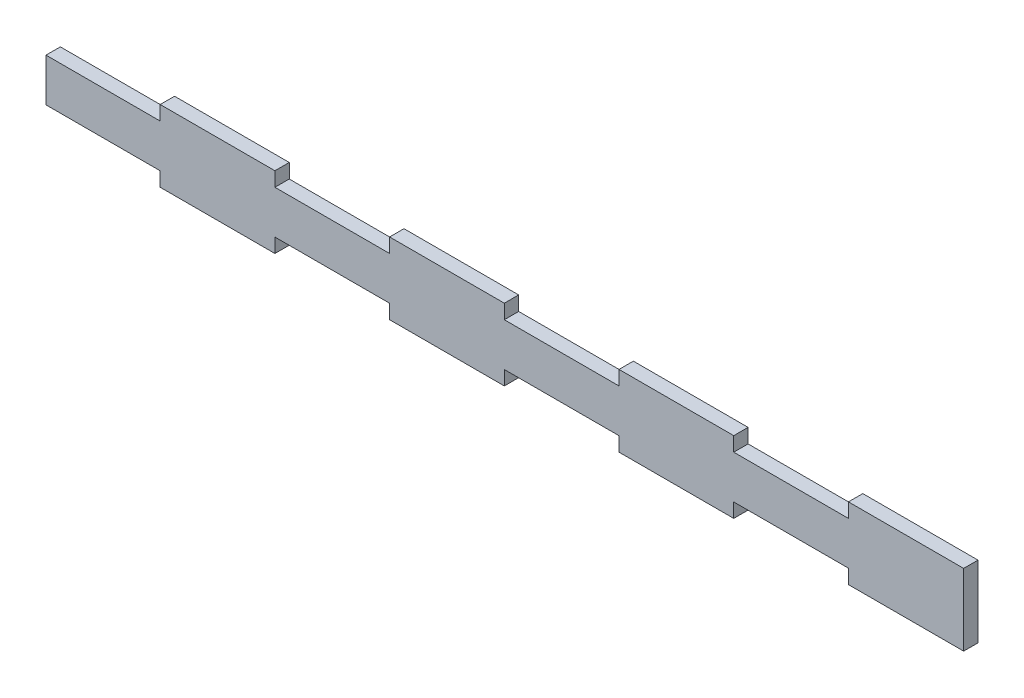
ISO-10303-21;
HEADER;
FILE_DESCRIPTION(('STEP AP214'),'2;1');
FILE_NAME('part.step','',(''),(''),'','','');
FILE_SCHEMA(('AUTOMOTIVE_DESIGN { 1 0 10303 214 1 1 1 1 }'));
ENDSEC;
DATA;
#1=APPLICATION_CONTEXT('core data for automotive mechanical design processes');
#2=APPLICATION_PROTOCOL_DEFINITION('international standard','automotive_design',2000,#1);
#3=PRODUCT_CONTEXT('',#1,'mechanical');
#4=PRODUCT('Part','Part','',(#3));
#5=PRODUCT_RELATED_PRODUCT_CATEGORY('part','',(#4));
#6=PRODUCT_DEFINITION_FORMATION('','',#4);
#7=PRODUCT_DEFINITION_CONTEXT('part definition',#1,'design');
#8=PRODUCT_DEFINITION('design','',#6,#7);
#9=PRODUCT_DEFINITION_SHAPE('','',#8);
#10=(LENGTH_UNIT() NAMED_UNIT(*) SI_UNIT(.MILLI.,.METRE.));
#11=(NAMED_UNIT(*) PLANE_ANGLE_UNIT() SI_UNIT($,.RADIAN.));
#12=(NAMED_UNIT(*) SI_UNIT($,.STERADIAN.) SOLID_ANGLE_UNIT());
#13=UNCERTAINTY_MEASURE_WITH_UNIT(LENGTH_MEASURE(1.E-05),#10,'distance_accuracy_value','');
#14=(GEOMETRIC_REPRESENTATION_CONTEXT(3) GLOBAL_UNCERTAINTY_ASSIGNED_CONTEXT((#13)) GLOBAL_UNIT_ASSIGNED_CONTEXT((#10,
#11,#12)) REPRESENTATION_CONTEXT('',''));
#15=CARTESIAN_POINT('',(0.,0.,0.));
#16=DIRECTION('',(0.,0.,1.));
#17=DIRECTION('',(1.,0.,0.));
#18=AXIS2_PLACEMENT_3D('',#15,#16,#17);
#19=CARTESIAN_POINT('',(-101.488995414504,-7.92882776675809,3.175));
#20=DIRECTION('',(0.,1.,0.));
#21=DIRECTION('',(0.,0.,1.));
#22=AXIS2_PLACEMENT_3D('',#19,#20,#21);
#23=PLANE('',#22);
#24=DIRECTION('',(1.,0.,0.));
#25=VECTOR('',#24,1.);
#26=CARTESIAN_POINT('',(-101.488995414504,-7.92882776675809,0.));
#27=LINE('',#26,#25);
#28=CARTESIAN_POINT('',(25.3999999999998,-7.92882776675809,0.));
#29=VERTEX_POINT('',#28);
#30=CARTESIAN_POINT('',(50.7999999999998,-7.92882776675809,0.));
#31=VERTEX_POINT('',#30);
#32=EDGE_CURVE('E540',#29,#31,#27,.T.);
#33=ORIENTED_EDGE('',*,*,#32,.T.);
#34=DIRECTION('',(0.,0.,1.));
#35=VECTOR('',#34,1.);
#36=CARTESIAN_POINT('',(50.7999999999998,-7.92882776675809,3.175));
#37=LINE('',#36,#35);
#38=CARTESIAN_POINT('',(50.7999999999998,-7.92882776675809,3.175));
#39=VERTEX_POINT('',#38);
#40=EDGE_CURVE('E501',#31,#39,#37,.T.);
#41=ORIENTED_EDGE('',*,*,#40,.T.);
#42=DIRECTION('',(1.,0.,0.));
#43=VECTOR('',#42,1.);
#44=CARTESIAN_POINT('',(-101.488995414504,-7.92882776675809,3.175));
#45=LINE('',#44,#43);
#46=CARTESIAN_POINT('',(25.3999999999998,-7.92882776675809,3.175));
#47=VERTEX_POINT('',#46);
#48=EDGE_CURVE('E523',#47,#39,#45,.T.);
#49=ORIENTED_EDGE('',*,*,#48,.F.);
#50=DIRECTION('',(0.,0.,-1.));
#51=VECTOR('',#50,1.);
#52=CARTESIAN_POINT('',(25.3999999999998,-7.92882776675809,3.175));
#53=LINE('',#52,#51);
#54=EDGE_CURVE('E491',#47,#29,#53,.T.);
#55=ORIENTED_EDGE('',*,*,#54,.T.);
#56=EDGE_LOOP('',(#33,#41,#49,#55));
#57=FACE_BOUND('',#56,.T.);
#58=ADVANCED_FACE('F39',(#57),#23,.F.);
#59=CARTESIAN_POINT('',(-25.4000000000002,-7.92882776675809,0.));
#60=VERTEX_POINT('',#59);
#61=CARTESIAN_POINT('',(-2.08166817117217E-13,-7.92882776675809,0.));
#62=VERTEX_POINT('',#61);
#63=EDGE_CURVE('E567',#60,#62,#27,.T.);
#64=ORIENTED_EDGE('',*,*,#63,.T.);
#65=DIRECTION('',(0.,0.,1.));
#66=VECTOR('',#65,1.);
#67=CARTESIAN_POINT('',(-2.08166817117217E-13,-7.92882776675809,3.175));
#68=LINE('',#67,#66);
#69=CARTESIAN_POINT('',(-2.08166817117217E-13,-7.92882776675809,3.175));
#70=VERTEX_POINT('',#69);
#71=EDGE_CURVE('E266',#62,#70,#68,.T.);
#72=ORIENTED_EDGE('',*,*,#71,.T.);
#73=CARTESIAN_POINT('',(-25.4000000000002,-7.92882776675809,3.175));
#74=VERTEX_POINT('',#73);
#75=EDGE_CURVE('E591',#74,#70,#45,.T.);
#76=ORIENTED_EDGE('',*,*,#75,.F.);
#77=DIRECTION('',(0.,0.,-1.));
#78=VECTOR('',#77,1.);
#79=CARTESIAN_POINT('',(-25.4000000000002,-7.92882776675809,3.175));
#80=LINE('',#79,#78);
#81=EDGE_CURVE('E483',#74,#60,#80,.T.);
#82=ORIENTED_EDGE('',*,*,#81,.T.);
#83=EDGE_LOOP('',(#64,#72,#76,#82));
#84=FACE_BOUND('',#83,.T.);
#85=ADVANCED_FACE('F598',(#84),#23,.F.);
#86=CARTESIAN_POINT('',(-76.2000000000002,-7.92882776675809,0.));
#87=VERTEX_POINT('',#86);
#88=CARTESIAN_POINT('',(-50.8000000000002,-7.92882776675809,0.));
#89=VERTEX_POINT('',#88);
#90=EDGE_CURVE('E511',#87,#89,#27,.T.);
#91=ORIENTED_EDGE('',*,*,#90,.T.);
#92=DIRECTION('',(0.,0.,1.));
#93=VECTOR('',#92,1.);
#94=CARTESIAN_POINT('',(-50.8000000000002,-7.92882776675809,3.175));
#95=LINE('',#94,#93);
#96=CARTESIAN_POINT('',(-50.8000000000002,-7.92882776675809,3.175));
#97=VERTEX_POINT('',#96);
#98=EDGE_CURVE('E487',#89,#97,#95,.T.);
#99=ORIENTED_EDGE('',*,*,#98,.T.);
#100=CARTESIAN_POINT('',(-76.2000000000002,-7.92882776675809,3.175));
#101=VERTEX_POINT('',#100);
#102=EDGE_CURVE('E524',#101,#97,#45,.T.);
#103=ORIENTED_EDGE('',*,*,#102,.F.);
#104=DIRECTION('',(0.,0.,-1.));
#105=VECTOR('',#104,1.);
#106=CARTESIAN_POINT('',(-76.2000000000002,-7.92882776675809,3.175));
#107=LINE('',#106,#105);
#108=EDGE_CURVE('E476',#101,#87,#107,.T.);
#109=ORIENTED_EDGE('',*,*,#108,.T.);
#110=EDGE_LOOP('',(#91,#99,#103,#109));
#111=FACE_BOUND('',#110,.T.);
#112=ADVANCED_FACE('F574',(#111),#23,.F.);
#113=CARTESIAN_POINT('',(-101.488995414504,7.94617223324191,3.175));
#114=DIRECTION('',(0.,1.,0.));
#115=DIRECTION('',(0.,0.,1.));
#116=AXIS2_PLACEMENT_3D('',#113,#114,#115);
#117=PLANE('',#116);
#118=DIRECTION('',(0.,0.,1.));
#119=VECTOR('',#118,1.);
#120=CARTESIAN_POINT('',(-25.4000000000002,7.94617223324191,0.));
#121=LINE('',#120,#119);
#122=CARTESIAN_POINT('',(-25.4000000000002,7.94617223324191,0.));
#123=VERTEX_POINT('',#122);
#124=CARTESIAN_POINT('',(-25.4000000000002,7.94617223324191,3.175));
#125=VERTEX_POINT('',#124);
#126=EDGE_CURVE('E350',#123,#125,#121,.T.);
#127=ORIENTED_EDGE('',*,*,#126,.T.);
#128=DIRECTION('',(1.,0.,0.));
#129=VECTOR('',#128,1.);
#130=CARTESIAN_POINT('',(-101.488995414504,7.94617223324191,3.175));
#131=LINE('',#130,#129);
#132=CARTESIAN_POINT('',(-2.08166817117217E-13,7.94617223324191,3.175));
#133=VERTEX_POINT('',#132);
#134=EDGE_CURVE('E680',#125,#133,#131,.T.);
#135=ORIENTED_EDGE('',*,*,#134,.T.);
#136=DIRECTION('',(0.,0.,1.));
#137=VECTOR('',#136,1.);
#138=CARTESIAN_POINT('',(-2.08166817117217E-13,7.94617223324191,0.));
#139=LINE('',#138,#137);
#140=CARTESIAN_POINT('',(-2.08166817117217E-13,7.94617223324191,0.));
#141=VERTEX_POINT('',#140);
#142=EDGE_CURVE('E374',#141,#133,#139,.T.);
#143=ORIENTED_EDGE('',*,*,#142,.F.);
#144=DIRECTION('',(1.,0.,0.));
#145=VECTOR('',#144,1.);
#146=CARTESIAN_POINT('',(-101.488995414504,7.94617223324191,0.));
#147=LINE('',#146,#145);
#148=EDGE_CURVE('E698',#123,#141,#147,.T.);
#149=ORIENTED_EDGE('',*,*,#148,.F.);
#150=EDGE_LOOP('',(#127,#135,#143,#149));
#151=FACE_BOUND('',#150,.T.);
#152=ADVANCED_FACE('F633',(#151),#117,.T.);
#153=DIRECTION('',(0.,0.,1.));
#154=VECTOR('',#153,1.);
#155=CARTESIAN_POINT('',(25.3999999999998,7.94617223324191,0.));
#156=LINE('',#155,#154);
#157=CARTESIAN_POINT('',(25.3999999999998,7.94617223324191,0.));
#158=VERTEX_POINT('',#157);
#159=CARTESIAN_POINT('',(25.3999999999998,7.94617223324191,3.175));
#160=VERTEX_POINT('',#159);
#161=EDGE_CURVE('E344',#158,#160,#156,.T.);
#162=ORIENTED_EDGE('',*,*,#161,.T.);
#163=CARTESIAN_POINT('',(50.7999999999998,7.94617223324191,3.175));
#164=VERTEX_POINT('',#163);
#165=EDGE_CURVE('E514',#160,#164,#131,.T.);
#166=ORIENTED_EDGE('',*,*,#165,.T.);
#167=DIRECTION('',(0.,0.,1.));
#168=VECTOR('',#167,1.);
#169=CARTESIAN_POINT('',(50.7999999999998,7.94617223324191,0.));
#170=LINE('',#169,#168);
#171=CARTESIAN_POINT('',(50.7999999999998,7.94617223324191,0.));
#172=VERTEX_POINT('',#171);
#173=EDGE_CURVE('E410',#172,#164,#170,.T.);
#174=ORIENTED_EDGE('',*,*,#173,.F.);
#175=EDGE_CURVE('E531',#158,#172,#147,.T.);
#176=ORIENTED_EDGE('',*,*,#175,.F.);
#177=EDGE_LOOP('',(#162,#166,#174,#176));
#178=FACE_BOUND('',#177,.T.);
#179=ADVANCED_FACE('F637',(#178),#117,.T.);
#180=DIRECTION('',(0.,0.,1.));
#181=VECTOR('',#180,1.);
#182=CARTESIAN_POINT('',(76.1999999999998,7.94617223324191,0.));
#183=LINE('',#182,#181);
#184=CARTESIAN_POINT('',(76.1999999999998,7.94617223324191,0.));
#185=VERTEX_POINT('',#184);
#186=CARTESIAN_POINT('',(76.1999999999998,7.94617223324191,3.175));
#187=VERTEX_POINT('',#186);
#188=EDGE_CURVE('E380',#185,#187,#183,.T.);
#189=ORIENTED_EDGE('',*,*,#188,.T.);
#190=CARTESIAN_POINT('',(101.711004585496,7.94617223324191,3.175));
#191=VERTEX_POINT('',#190);
#192=EDGE_CURVE('E510',#187,#191,#131,.T.);
#193=ORIENTED_EDGE('',*,*,#192,.T.);
#194=DIRECTION('',(0.,0.,-1.));
#195=VECTOR('',#194,1.);
#196=CARTESIAN_POINT('',(101.711004585496,7.94617223324191,3.175));
#197=LINE('',#196,#195);
#198=CARTESIAN_POINT('',(101.711004585496,7.94617223324191,0.));
#199=VERTEX_POINT('',#198);
#200=EDGE_CURVE('E546',#191,#199,#197,.T.);
#201=ORIENTED_EDGE('',*,*,#200,.T.);
#202=EDGE_CURVE('E528',#185,#199,#147,.T.);
#203=ORIENTED_EDGE('',*,*,#202,.F.);
#204=EDGE_LOOP('',(#189,#193,#201,#203));
#205=FACE_BOUND('',#204,.T.);
#206=ADVANCED_FACE('F629',(#205),#117,.T.);
#207=CARTESIAN_POINT('',(-101.488995414504,-7.92882776675809,3.175));
#208=DIRECTION('',(-1.,0.,0.));
#209=DIRECTION('',(0.,0.,1.));
#210=AXIS2_PLACEMENT_3D('',#207,#208,#209);
#211=PLANE('',#210);
#212=DIRECTION('',(0.,0.,-1.));
#213=VECTOR('',#212,1.);
#214=CARTESIAN_POINT('',(-101.488995414504,-4.77117223324191,3.175));
#215=LINE('',#214,#213);
#216=CARTESIAN_POINT('',(-101.488995414504,-4.77117223324191,3.175));
#217=VERTEX_POINT('',#216);
#218=CARTESIAN_POINT('',(-101.488995414504,-4.77117223324191,0.));
#219=VERTEX_POINT('',#218);
#220=EDGE_CURVE('E480',#217,#219,#215,.T.);
#221=ORIENTED_EDGE('',*,*,#220,.F.);
#222=DIRECTION('',(0.,1.,0.));
#223=VECTOR('',#222,1.);
#224=CARTESIAN_POINT('',(-101.488995414504,-7.92882776675809,3.175));
#225=LINE('',#224,#223);
#226=CARTESIAN_POINT('',(-101.488995414504,4.77117223324191,3.175));
#227=VERTEX_POINT('',#226);
#228=EDGE_CURVE('E506',#217,#227,#225,.T.);
#229=ORIENTED_EDGE('',*,*,#228,.T.);
#230=DIRECTION('',(0.,0.,1.));
#231=VECTOR('',#230,1.);
#232=CARTESIAN_POINT('',(-101.488995414504,4.77117223324191,3.175));
#233=LINE('',#232,#231);
#234=CARTESIAN_POINT('',(-101.488995414504,4.77117223324191,0.));
#235=VERTEX_POINT('',#234);
#236=EDGE_CURVE('E470',#235,#227,#233,.T.);
#237=ORIENTED_EDGE('',*,*,#236,.F.);
#238=DIRECTION('',(0.,1.,0.));
#239=VECTOR('',#238,1.);
#240=CARTESIAN_POINT('',(-101.488995414504,-7.92882776675809,0.));
#241=LINE('',#240,#239);
#242=EDGE_CURVE('E505',#219,#235,#241,.T.);
#243=ORIENTED_EDGE('',*,*,#242,.F.);
#244=EDGE_LOOP('',(#221,#229,#237,#243));
#245=FACE_BOUND('',#244,.T.);
#246=ADVANCED_FACE('F41',(#245),#211,.T.);
#247=CARTESIAN_POINT('',(76.1999999999998,-7.92882776675809,3.175));
#248=VERTEX_POINT('',#247);
#249=CARTESIAN_POINT('',(101.711004585496,-7.92882776675809,3.175));
#250=VERTEX_POINT('',#249);
#251=EDGE_CURVE('E520',#248,#250,#45,.T.);
#252=ORIENTED_EDGE('',*,*,#251,.F.);
#253=DIRECTION('',(0.,0.,-1.));
#254=VECTOR('',#253,1.);
#255=CARTESIAN_POINT('',(76.1999999999998,-7.92882776675809,3.175));
#256=LINE('',#255,#254);
#257=CARTESIAN_POINT('',(76.1999999999998,-7.92882776675809,0.));
#258=VERTEX_POINT('',#257);
#259=EDGE_CURVE('E497',#248,#258,#256,.T.);
#260=ORIENTED_EDGE('',*,*,#259,.T.);
#261=CARTESIAN_POINT('',(101.711004585496,-7.92882776675809,0.));
#262=VERTEX_POINT('',#261);
#263=EDGE_CURVE('E537',#258,#262,#27,.T.);
#264=ORIENTED_EDGE('',*,*,#263,.T.);
#265=DIRECTION('',(0.,0.,-1.));
#266=VECTOR('',#265,1.);
#267=CARTESIAN_POINT('',(101.711004585496,-7.92882776675809,3.175));
#268=LINE('',#267,#266);
#269=EDGE_CURVE('E541',#250,#262,#268,.T.);
#270=ORIENTED_EDGE('',*,*,#269,.F.);
#271=EDGE_LOOP('',(#252,#260,#264,#270));
#272=FACE_BOUND('',#271,.T.);
#273=ADVANCED_FACE('F614',(#272),#23,.F.);
#274=CARTESIAN_POINT('',(101.711004585496,-7.92882776675809,3.175));
#275=DIRECTION('',(-1.,0.,0.));
#276=DIRECTION('',(0.,0.,1.));
#277=AXIS2_PLACEMENT_3D('',#274,#275,#276);
#278=PLANE('',#277);
#279=DIRECTION('',(0.,1.,0.));
#280=VECTOR('',#279,1.);
#281=CARTESIAN_POINT('',(101.711004585496,-7.92882776675809,0.));
#282=LINE('',#281,#280);
#283=EDGE_CURVE('E533',#262,#199,#282,.T.);
#284=ORIENTED_EDGE('',*,*,#283,.T.);
#285=ORIENTED_EDGE('',*,*,#200,.F.);
#286=DIRECTION('',(0.,1.,0.));
#287=VECTOR('',#286,1.);
#288=CARTESIAN_POINT('',(101.711004585496,-7.92882776675809,3.175));
#289=LINE('',#288,#287);
#290=EDGE_CURVE('E516',#250,#191,#289,.T.);
#291=ORIENTED_EDGE('',*,*,#290,.F.);
#292=ORIENTED_EDGE('',*,*,#269,.T.);
#293=EDGE_LOOP('',(#284,#285,#291,#292));
#294=FACE_BOUND('',#293,.T.);
#295=ADVANCED_FACE('F621',(#294),#278,.F.);
#296=DIRECTION('',(0.,0.,1.));
#297=VECTOR('',#296,1.);
#298=CARTESIAN_POINT('',(-50.8000000000002,7.94617223324191,0.));
#299=LINE('',#298,#297);
#300=CARTESIAN_POINT('',(-50.8000000000002,7.94617223324191,0.));
#301=VERTEX_POINT('',#300);
#302=CARTESIAN_POINT('',(-50.8000000000002,7.94617223324191,3.175));
#303=VERTEX_POINT('',#302);
#304=EDGE_CURVE('E338',#301,#303,#299,.T.);
#305=ORIENTED_EDGE('',*,*,#304,.F.);
#306=CARTESIAN_POINT('',(-76.2000000000002,7.94617223324191,0.));
#307=VERTEX_POINT('',#306);
#308=EDGE_CURVE('E532',#307,#301,#147,.T.);
#309=ORIENTED_EDGE('',*,*,#308,.F.);
#310=DIRECTION('',(0.,0.,1.));
#311=VECTOR('',#310,1.);
#312=CARTESIAN_POINT('',(-76.2000000000002,7.94617223324191,0.));
#313=LINE('',#312,#311);
#314=CARTESIAN_POINT('',(-76.2000000000002,7.94617223324191,3.175));
#315=VERTEX_POINT('',#314);
#316=EDGE_CURVE('E466',#307,#315,#313,.T.);
#317=ORIENTED_EDGE('',*,*,#316,.T.);
#318=EDGE_CURVE('E515',#315,#303,#131,.T.);
#319=ORIENTED_EDGE('',*,*,#318,.T.);
#320=EDGE_LOOP('',(#305,#309,#317,#319));
#321=FACE_BOUND('',#320,.T.);
#322=ADVANCED_FACE('F627',(#321),#117,.T.);
#323=CARTESIAN_POINT('',(0.,0.,3.175));
#324=DIRECTION('',(0.,0.,-1.));
#325=DIRECTION('',(-1.,0.,0.));
#326=AXIS2_PLACEMENT_3D('',#323,#324,#325);
#327=PLANE('',#326);
#328=ORIENTED_EDGE('',*,*,#134,.F.);
#329=DIRECTION('',(0.,1.,0.));
#330=VECTOR('',#329,1.);
#331=CARTESIAN_POINT('',(-25.4000000000002,7.94617223324191,3.175));
#332=LINE('',#331,#330);
#333=CARTESIAN_POINT('',(-25.4000000000002,4.77117223324191,3.175));
#334=VERTEX_POINT('',#333);
#335=EDGE_CURVE('E332',#334,#125,#332,.T.);
#336=ORIENTED_EDGE('',*,*,#335,.F.);
#337=DIRECTION('',(1.,0.,0.));
#338=VECTOR('',#337,1.);
#339=CARTESIAN_POINT('',(-50.8000000000002,4.77117223324191,3.175));
#340=LINE('',#339,#338);
#341=CARTESIAN_POINT('',(-50.8000000000002,4.77117223324191,3.175));
#342=VERTEX_POINT('',#341);
#343=EDGE_CURVE('E343',#342,#334,#340,.T.);
#344=ORIENTED_EDGE('',*,*,#343,.F.);
#345=DIRECTION('',(0.,-1.,0.));
#346=VECTOR('',#345,1.);
#347=CARTESIAN_POINT('',(-50.8000000000002,7.94617223324191,3.175));
#348=LINE('',#347,#346);
#349=EDGE_CURVE('E339',#303,#342,#348,.T.);
#350=ORIENTED_EDGE('',*,*,#349,.F.);
#351=ORIENTED_EDGE('',*,*,#318,.F.);
#352=DIRECTION('',(0.,1.,0.));
#353=VECTOR('',#352,1.);
#354=CARTESIAN_POINT('',(-76.2000000000002,7.94617223324191,3.175));
#355=LINE('',#354,#353);
#356=CARTESIAN_POINT('',(-76.2000000000002,4.77117223324191,3.175));
#357=VERTEX_POINT('',#356);
#358=EDGE_CURVE('E461',#357,#315,#355,.T.);
#359=ORIENTED_EDGE('',*,*,#358,.F.);
#360=DIRECTION('',(1.,0.,0.));
#361=VECTOR('',#360,1.);
#362=CARTESIAN_POINT('',(-101.6,4.77117223324191,3.175));
#363=LINE('',#362,#361);
#364=EDGE_CURVE('E354',#227,#357,#363,.T.);
#365=ORIENTED_EDGE('',*,*,#364,.F.);
#366=ORIENTED_EDGE('',*,*,#228,.F.);
#367=DIRECTION('',(-1.,0.,0.));
#368=VECTOR('',#367,1.);
#369=CARTESIAN_POINT('',(-101.6,-4.77117223324191,3.175));
#370=LINE('',#369,#368);
#371=CARTESIAN_POINT('',(-76.2000000000002,-4.77117223324191,3.175));
#372=VERTEX_POINT('',#371);
#373=EDGE_CURVE('E319',#372,#217,#370,.T.);
#374=ORIENTED_EDGE('',*,*,#373,.F.);
#375=DIRECTION('',(0.,1.,0.));
#376=VECTOR('',#375,1.);
#377=CARTESIAN_POINT('',(-76.2000000000002,-7.94617223324191,3.175));
#378=LINE('',#377,#376);
#379=EDGE_CURVE('E320',#101,#372,#378,.T.);
#380=ORIENTED_EDGE('',*,*,#379,.F.);
#381=ORIENTED_EDGE('',*,*,#102,.T.);
#382=DIRECTION('',(0.,-1.,0.));
#383=VECTOR('',#382,1.);
#384=CARTESIAN_POINT('',(-50.8000000000002,-7.94617223324191,3.175));
#385=LINE('',#384,#383);
#386=CARTESIAN_POINT('',(-50.8000000000002,-4.77117223324191,3.175));
#387=VERTEX_POINT('',#386);
#388=EDGE_CURVE('E300',#387,#97,#385,.T.);
#389=ORIENTED_EDGE('',*,*,#388,.F.);
#390=DIRECTION('',(-1.,0.,0.));
#391=VECTOR('',#390,1.);
#392=CARTESIAN_POINT('',(-50.8000000000002,-4.77117223324191,3.175));
#393=LINE('',#392,#391);
#394=CARTESIAN_POINT('',(-25.4000000000002,-4.77117223324191,3.175));
#395=VERTEX_POINT('',#394);
#396=EDGE_CURVE('E295',#395,#387,#393,.T.);
#397=ORIENTED_EDGE('',*,*,#396,.F.);
#398=DIRECTION('',(0.,1.,0.));
#399=VECTOR('',#398,1.);
#400=CARTESIAN_POINT('',(-25.4000000000002,-7.94617223324191,3.175));
#401=LINE('',#400,#399);
#402=EDGE_CURVE('E303',#74,#395,#401,.T.);
#403=ORIENTED_EDGE('',*,*,#402,.F.);
#404=ORIENTED_EDGE('',*,*,#75,.T.);
#405=DIRECTION('',(0.,-1.,0.));
#406=VECTOR('',#405,1.);
#407=CARTESIAN_POINT('',(-2.08166817117217E-13,-7.94617223324191,3.175));
#408=LINE('',#407,#406);
#409=CARTESIAN_POINT('',(-2.08166817117217E-13,-4.77117223324191,3.175));
#410=VERTEX_POINT('',#409);
#411=EDGE_CURVE('E281',#410,#70,#408,.T.);
#412=ORIENTED_EDGE('',*,*,#411,.F.);
#413=DIRECTION('',(-1.,0.,0.));
#414=VECTOR('',#413,1.);
#415=CARTESIAN_POINT('',(-2.08166817117217E-13,-4.77117223324191,3.175));
#416=LINE('',#415,#414);
#417=CARTESIAN_POINT('',(25.3999999999998,-4.77117223324191,3.175));
#418=VERTEX_POINT('',#417);
#419=EDGE_CURVE('E255',#418,#410,#416,.T.);
#420=ORIENTED_EDGE('',*,*,#419,.F.);
#421=DIRECTION('',(0.,1.,0.));
#422=VECTOR('',#421,1.);
#423=CARTESIAN_POINT('',(25.3999999999998,-7.94617223324191,3.175));
#424=LINE('',#423,#422);
#425=EDGE_CURVE('E284',#47,#418,#424,.T.);
#426=ORIENTED_EDGE('',*,*,#425,.F.);
#427=ORIENTED_EDGE('',*,*,#48,.T.);
#428=DIRECTION('',(0.,-1.,0.));
#429=VECTOR('',#428,1.);
#430=CARTESIAN_POINT('',(50.7999999999998,-7.94617223324191,3.175));
#431=LINE('',#430,#429);
#432=CARTESIAN_POINT('',(50.7999999999998,-4.77117223324191,3.175));
#433=VERTEX_POINT('',#432);
#434=EDGE_CURVE('E259',#433,#39,#431,.T.);
#435=ORIENTED_EDGE('',*,*,#434,.F.);
#436=DIRECTION('',(-1.,0.,0.));
#437=VECTOR('',#436,1.);
#438=CARTESIAN_POINT('',(50.7999999999998,-4.77117223324191,3.175));
#439=LINE('',#438,#437);
#440=CARTESIAN_POINT('',(76.1999999999998,-4.77117223324191,3.175));
#441=VERTEX_POINT('',#440);
#442=EDGE_CURVE('E438',#441,#433,#439,.T.);
#443=ORIENTED_EDGE('',*,*,#442,.F.);
#444=DIRECTION('',(0.,1.,0.));
#445=VECTOR('',#444,1.);
#446=CARTESIAN_POINT('',(76.1999999999998,-7.94617223324191,3.175));
#447=LINE('',#446,#445);
#448=EDGE_CURVE('E445',#248,#441,#447,.T.);
#449=ORIENTED_EDGE('',*,*,#448,.F.);
#450=ORIENTED_EDGE('',*,*,#251,.T.);
#451=ORIENTED_EDGE('',*,*,#290,.T.);
#452=ORIENTED_EDGE('',*,*,#192,.F.);
#453=DIRECTION('',(0.,1.,0.));
#454=VECTOR('',#453,1.);
#455=CARTESIAN_POINT('',(76.1999999999998,7.94617223324191,3.175));
#456=LINE('',#455,#454);
#457=CARTESIAN_POINT('',(76.1999999999998,4.77117223324191,3.175));
#458=VERTEX_POINT('',#457);
#459=EDGE_CURVE('E402',#458,#187,#456,.T.);
#460=ORIENTED_EDGE('',*,*,#459,.F.);
#461=DIRECTION('',(1.,0.,0.));
#462=VECTOR('',#461,1.);
#463=CARTESIAN_POINT('',(50.7999999999998,4.77117223324191,3.175));
#464=LINE('',#463,#462);
#465=CARTESIAN_POINT('',(50.7999999999998,4.77117223324191,3.175));
#466=VERTEX_POINT('',#465);
#467=EDGE_CURVE('E415',#466,#458,#464,.T.);
#468=ORIENTED_EDGE('',*,*,#467,.F.);
#469=DIRECTION('',(0.,-1.,0.));
#470=VECTOR('',#469,1.);
#471=CARTESIAN_POINT('',(50.7999999999998,7.94617223324191,3.175));
#472=LINE('',#471,#470);
#473=EDGE_CURVE('E411',#164,#466,#472,.T.);
#474=ORIENTED_EDGE('',*,*,#473,.F.);
#475=ORIENTED_EDGE('',*,*,#165,.F.);
#476=DIRECTION('',(0.,1.,0.));
#477=VECTOR('',#476,1.);
#478=CARTESIAN_POINT('',(25.3999999999998,7.94617223324191,3.175));
#479=LINE('',#478,#477);
#480=CARTESIAN_POINT('',(25.3999999999998,4.77117223324191,3.175));
#481=VERTEX_POINT('',#480);
#482=EDGE_CURVE('E367',#481,#160,#479,.T.);
#483=ORIENTED_EDGE('',*,*,#482,.F.);
#484=DIRECTION('',(1.,0.,0.));
#485=VECTOR('',#484,1.);
#486=CARTESIAN_POINT('',(-2.08166817117217E-13,4.77117223324191,3.175));
#487=LINE('',#486,#485);
#488=CARTESIAN_POINT('',(-2.08166817117217E-13,4.77117223324191,3.175));
#489=VERTEX_POINT('',#488);
#490=EDGE_CURVE('E379',#489,#481,#487,.T.);
#491=ORIENTED_EDGE('',*,*,#490,.F.);
#492=DIRECTION('',(0.,-1.,0.));
#493=VECTOR('',#492,1.);
#494=CARTESIAN_POINT('',(-2.08166817117217E-13,7.94617223324191,3.175));
#495=LINE('',#494,#493);
#496=EDGE_CURVE('E375',#133,#489,#495,.T.);
#497=ORIENTED_EDGE('',*,*,#496,.F.);
#498=EDGE_LOOP('',(#328,#336,#344,#350,#351,#359,#365,#366,#374,#380,#381,#389,#397,#403,#404,
#412,#420,#426,#427,#435,#443,#449,#450,#451,#452,#460,#468,#474,#475,#483,#491,#497));
#499=FACE_BOUND('',#498,.T.);
#500=ADVANCED_FACE('F586',(#499),#327,.F.);
#501=CARTESIAN_POINT('',(0.,0.,0.));
#502=DIRECTION('',(0.,0.,-1.));
#503=DIRECTION('',(-1.,0.,0.));
#504=AXIS2_PLACEMENT_3D('',#501,#502,#503);
#505=PLANE('',#504);
#506=DIRECTION('',(0.,1.,0.));
#507=VECTOR('',#506,1.);
#508=CARTESIAN_POINT('',(-25.4000000000002,7.94617223324191,0.));
#509=LINE('',#508,#507);
#510=CARTESIAN_POINT('',(-25.4000000000002,4.77117223324191,0.));
#511=VERTEX_POINT('',#510);
#512=EDGE_CURVE('E335',#511,#123,#509,.T.);
#513=ORIENTED_EDGE('',*,*,#512,.T.);
#514=ORIENTED_EDGE('',*,*,#148,.T.);
#515=DIRECTION('',(0.,-1.,0.));
#516=VECTOR('',#515,1.);
#517=CARTESIAN_POINT('',(-2.08166817117217E-13,7.94617223324191,0.));
#518=LINE('',#517,#516);
#519=CARTESIAN_POINT('',(0.,4.77117223324191,0.));
#520=VERTEX_POINT('',#519);
#521=EDGE_CURVE('E363',#141,#520,#518,.T.);
#522=ORIENTED_EDGE('',*,*,#521,.T.);
#523=DIRECTION('',(1.,0.,0.));
#524=VECTOR('',#523,1.);
#525=CARTESIAN_POINT('',(-2.08166817117217E-13,4.77117223324191,0.));
#526=LINE('',#525,#524);
#527=CARTESIAN_POINT('',(25.3999999999998,4.77117223324191,0.));
#528=VERTEX_POINT('',#527);
#529=EDGE_CURVE('E63',#520,#528,#526,.T.);
#530=ORIENTED_EDGE('',*,*,#529,.T.);
#531=DIRECTION('',(0.,1.,0.));
#532=VECTOR('',#531,1.);
#533=CARTESIAN_POINT('',(25.3999999999998,7.94617223324191,0.));
#534=LINE('',#533,#532);
#535=EDGE_CURVE('E370',#528,#158,#534,.T.);
#536=ORIENTED_EDGE('',*,*,#535,.T.);
#537=ORIENTED_EDGE('',*,*,#175,.T.);
#538=DIRECTION('',(0.,-1.,0.));
#539=VECTOR('',#538,1.);
#540=CARTESIAN_POINT('',(50.7999999999998,7.94617223324191,0.));
#541=LINE('',#540,#539);
#542=CARTESIAN_POINT('',(50.7999999999998,4.77117223324191,0.));
#543=VERTEX_POINT('',#542);
#544=EDGE_CURVE('E397',#172,#543,#541,.T.);
#545=ORIENTED_EDGE('',*,*,#544,.T.);
#546=DIRECTION('',(1.,0.,0.));
#547=VECTOR('',#546,1.);
#548=CARTESIAN_POINT('',(50.7999999999998,4.77117223324191,0.));
#549=LINE('',#548,#547);
#550=CARTESIAN_POINT('',(76.1999999999998,4.77117223324191,0.));
#551=VERTEX_POINT('',#550);
#552=EDGE_CURVE('E401',#543,#551,#549,.T.);
#553=ORIENTED_EDGE('',*,*,#552,.T.);
#554=DIRECTION('',(0.,1.,0.));
#555=VECTOR('',#554,1.);
#556=CARTESIAN_POINT('',(76.1999999999998,7.94617223324191,0.));
#557=LINE('',#556,#555);
#558=EDGE_CURVE('E406',#551,#185,#557,.T.);
#559=ORIENTED_EDGE('',*,*,#558,.T.);
#560=ORIENTED_EDGE('',*,*,#202,.T.);
#561=ORIENTED_EDGE('',*,*,#283,.F.);
#562=ORIENTED_EDGE('',*,*,#263,.F.);
#563=DIRECTION('',(0.,-1.,0.));
#564=VECTOR('',#563,1.);
#565=CARTESIAN_POINT('',(76.1999999999998,0.,0.));
#566=LINE('',#565,#564);
#567=CARTESIAN_POINT('',(76.1999999999998,-4.77117223324191,0.));
#568=VERTEX_POINT('',#567);
#569=EDGE_CURVE('E11',#568,#258,#566,.T.);
#570=ORIENTED_EDGE('',*,*,#569,.F.);
#571=DIRECTION('',(-1.,0.,0.));
#572=VECTOR('',#571,1.);
#573=CARTESIAN_POINT('',(50.7999999999998,-4.77117223324191,0.));
#574=LINE('',#573,#572);
#575=CARTESIAN_POINT('',(50.7999999999998,-4.77117223324191,0.));
#576=VERTEX_POINT('',#575);
#577=EDGE_CURVE('E437',#568,#576,#574,.T.);
#578=ORIENTED_EDGE('',*,*,#577,.T.);
#579=DIRECTION('',(0.,-1.,0.));
#580=VECTOR('',#579,1.);
#581=CARTESIAN_POINT('',(50.7999999999998,-7.94617223324191,0.));
#582=LINE('',#581,#580);
#583=EDGE_CURVE('E433',#576,#31,#582,.T.);
#584=ORIENTED_EDGE('',*,*,#583,.T.);
#585=ORIENTED_EDGE('',*,*,#32,.F.);
#586=DIRECTION('',(0.,-1.,0.));
#587=VECTOR('',#586,1.);
#588=CARTESIAN_POINT('',(25.3999999999998,0.,0.));
#589=LINE('',#588,#587);
#590=CARTESIAN_POINT('',(25.3999999999998,-4.77117223324191,0.));
#591=VERTEX_POINT('',#590);
#592=EDGE_CURVE('E48',#591,#29,#589,.T.);
#593=ORIENTED_EDGE('',*,*,#592,.F.);
#594=DIRECTION('',(-1.,0.,0.));
#595=VECTOR('',#594,1.);
#596=CARTESIAN_POINT('',(-2.08166817117217E-13,-4.77117223324191,0.));
#597=LINE('',#596,#595);
#598=CARTESIAN_POINT('',(-2.08166817117217E-13,-4.77117223324191,0.));
#599=VERTEX_POINT('',#598);
#600=EDGE_CURVE('E252',#591,#599,#597,.T.);
#601=ORIENTED_EDGE('',*,*,#600,.T.);
#602=DIRECTION('',(0.,-1.,0.));
#603=VECTOR('',#602,1.);
#604=CARTESIAN_POINT('',(-2.08166817117217E-13,-7.94617223324191,0.));
#605=LINE('',#604,#603);
#606=EDGE_CURVE('E263',#599,#62,#605,.T.);
#607=ORIENTED_EDGE('',*,*,#606,.T.);
#608=ORIENTED_EDGE('',*,*,#63,.F.);
#609=DIRECTION('',(0.,-1.,0.));
#610=VECTOR('',#609,1.);
#611=CARTESIAN_POINT('',(-25.4000000000002,0.,0.));
#612=LINE('',#611,#610);
#613=CARTESIAN_POINT('',(-25.4000000000002,-4.77117223324191,0.));
#614=VERTEX_POINT('',#613);
#615=EDGE_CURVE('E555',#614,#60,#612,.T.);
#616=ORIENTED_EDGE('',*,*,#615,.F.);
#617=DIRECTION('',(-1.,0.,0.));
#618=VECTOR('',#617,1.);
#619=CARTESIAN_POINT('',(-50.8000000000002,-4.77117223324191,0.));
#620=LINE('',#619,#618);
#621=CARTESIAN_POINT('',(-50.8000000000002,-4.77117223324191,0.));
#622=VERTEX_POINT('',#621);
#623=EDGE_CURVE('E294',#614,#622,#620,.T.);
#624=ORIENTED_EDGE('',*,*,#623,.T.);
#625=DIRECTION('',(0.,-1.,0.));
#626=VECTOR('',#625,1.);
#627=CARTESIAN_POINT('',(-50.8000000000002,-7.94617223324191,0.));
#628=LINE('',#627,#626);
#629=EDGE_CURVE('E290',#622,#89,#628,.T.);
#630=ORIENTED_EDGE('',*,*,#629,.T.);
#631=ORIENTED_EDGE('',*,*,#90,.F.);
#632=DIRECTION('',(0.,-1.,0.));
#633=VECTOR('',#632,1.);
#634=CARTESIAN_POINT('',(-76.2000000000002,0.,0.));
#635=LINE('',#634,#633);
#636=CARTESIAN_POINT('',(-76.2000000000002,-4.77117223324191,0.));
#637=VERTEX_POINT('',#636);
#638=EDGE_CURVE('E552',#637,#87,#635,.T.);
#639=ORIENTED_EDGE('',*,*,#638,.F.);
#640=DIRECTION('',(-1.,0.,0.));
#641=VECTOR('',#640,1.);
#642=CARTESIAN_POINT('',(-101.6,-4.77117223324191,0.));
#643=LINE('',#642,#641);
#644=EDGE_CURVE('E315',#637,#219,#643,.T.);
#645=ORIENTED_EDGE('',*,*,#644,.T.);
#646=ORIENTED_EDGE('',*,*,#242,.T.);
#647=DIRECTION('',(-1.,0.,0.));
#648=VECTOR('',#647,1.);
#649=CARTESIAN_POINT('',(0.,4.77117223324191,0.));
#650=LINE('',#649,#648);
#651=CARTESIAN_POINT('',(-76.2000000000002,4.77117223324191,0.));
#652=VERTEX_POINT('',#651);
#653=EDGE_CURVE('E545',#652,#235,#650,.T.);
#654=ORIENTED_EDGE('',*,*,#653,.F.);
#655=DIRECTION('',(0.,1.,0.));
#656=VECTOR('',#655,1.);
#657=CARTESIAN_POINT('',(-76.2000000000002,7.94617223324191,0.));
#658=LINE('',#657,#656);
#659=EDGE_CURVE('E456',#652,#307,#658,.T.);
#660=ORIENTED_EDGE('',*,*,#659,.T.);
#661=ORIENTED_EDGE('',*,*,#308,.T.);
#662=DIRECTION('',(0.,-1.,0.));
#663=VECTOR('',#662,1.);
#664=CARTESIAN_POINT('',(-50.8000000000002,7.94617223324191,0.));
#665=LINE('',#664,#663);
#666=CARTESIAN_POINT('',(-50.8000000000002,4.77117223324191,0.));
#667=VERTEX_POINT('',#666);
#668=EDGE_CURVE('E328',#301,#667,#665,.T.);
#669=ORIENTED_EDGE('',*,*,#668,.T.);
#670=DIRECTION('',(1.,0.,0.));
#671=VECTOR('',#670,1.);
#672=CARTESIAN_POINT('',(-50.8000000000002,4.77117223324191,0.));
#673=LINE('',#672,#671);
#674=EDGE_CURVE('E55',#667,#511,#673,.T.);
#675=ORIENTED_EDGE('',*,*,#674,.T.);
#676=EDGE_LOOP('',(#513,#514,#522,#530,#536,#537,#545,#553,#559,#560,#561,#562,#570,#578,#584,
#585,#593,#601,#607,#608,#616,#624,#630,#631,#639,#645,#646,#654,#660,#661,#669,#675));
#677=FACE_BOUND('',#676,.T.);
#678=ADVANCED_FACE('F274',(#677),#505,.T.);
#679=CARTESIAN_POINT('',(-76.2000000000002,7.94617223324191,0.));
#680=DIRECTION('',(1.,0.,0.));
#681=DIRECTION('',(0.,0.,-1.));
#682=AXIS2_PLACEMENT_3D('',#679,#680,#681);
#683=PLANE('',#682);
#684=ORIENTED_EDGE('',*,*,#358,.T.);
#685=ORIENTED_EDGE('',*,*,#316,.F.);
#686=ORIENTED_EDGE('',*,*,#659,.F.);
#687=DIRECTION('',(0.,0.,1.));
#688=VECTOR('',#687,1.);
#689=CARTESIAN_POINT('',(-76.2000000000002,4.77117223324191,0.));
#690=LINE('',#689,#688);
#691=EDGE_CURVE('E460',#652,#357,#690,.T.);
#692=ORIENTED_EDGE('',*,*,#691,.T.);
#693=EDGE_LOOP('',(#684,#685,#686,#692));
#694=FACE_BOUND('',#693,.T.);
#695=ADVANCED_FACE('F750',(#694),#683,.F.);
#696=CARTESIAN_POINT('',(-101.6,4.77117223324191,0.));
#697=DIRECTION('',(0.,-1.,0.));
#698=DIRECTION('',(1.,0.,0.));
#699=AXIS2_PLACEMENT_3D('',#696,#697,#698);
#700=PLANE('',#699);
#701=ORIENTED_EDGE('',*,*,#236,.T.);
#702=ORIENTED_EDGE('',*,*,#364,.T.);
#703=ORIENTED_EDGE('',*,*,#691,.F.);
#704=ORIENTED_EDGE('',*,*,#653,.T.);
#705=EDGE_LOOP('',(#701,#702,#703,#704));
#706=FACE_BOUND('',#705,.T.);
#707=ADVANCED_FACE('F753',(#706),#700,.F.);
#708=CARTESIAN_POINT('',(-76.2000000000002,-7.94617223324191,0.));
#709=DIRECTION('',(1.,0.,0.));
#710=DIRECTION('',(0.,0.,-1.));
#711=AXIS2_PLACEMENT_3D('',#708,#709,#710);
#712=PLANE('',#711);
#713=ORIENTED_EDGE('',*,*,#379,.T.);
#714=DIRECTION('',(0.,0.,1.));
#715=VECTOR('',#714,1.);
#716=CARTESIAN_POINT('',(-76.2000000000002,-4.77117223324191,0.));
#717=LINE('',#716,#715);
#718=EDGE_CURVE('E304',#637,#372,#717,.T.);
#719=ORIENTED_EDGE('',*,*,#718,.F.);
#720=ORIENTED_EDGE('',*,*,#638,.T.);
#721=ORIENTED_EDGE('',*,*,#108,.F.);
#722=EDGE_LOOP('',(#713,#719,#720,#721));
#723=FACE_BOUND('',#722,.T.);
#724=ADVANCED_FACE('F756',(#723),#712,.F.);
#725=CARTESIAN_POINT('',(-101.6,-4.77117223324191,0.));
#726=DIRECTION('',(0.,1.,0.));
#727=DIRECTION('',(-1.,0.,0.));
#728=AXIS2_PLACEMENT_3D('',#725,#726,#727);
#729=PLANE('',#728);
#730=ORIENTED_EDGE('',*,*,#220,.T.);
#731=ORIENTED_EDGE('',*,*,#644,.F.);
#732=ORIENTED_EDGE('',*,*,#718,.T.);
#733=ORIENTED_EDGE('',*,*,#373,.T.);
#734=EDGE_LOOP('',(#730,#731,#732,#733));
#735=FACE_BOUND('',#734,.T.);
#736=ADVANCED_FACE('F777',(#735),#729,.F.);
#737=CARTESIAN_POINT('',(-50.8000000000002,-7.94617223324191,0.));
#738=DIRECTION('',(-1.,0.,0.));
#739=DIRECTION('',(0.,0.,1.));
#740=AXIS2_PLACEMENT_3D('',#737,#738,#739);
#741=PLANE('',#740);
#742=ORIENTED_EDGE('',*,*,#629,.F.);
#743=DIRECTION('',(0.,0.,1.));
#744=VECTOR('',#743,1.);
#745=CARTESIAN_POINT('',(-50.8000000000002,-4.77117223324191,0.));
#746=LINE('',#745,#744);
#747=EDGE_CURVE('E285',#622,#387,#746,.T.);
#748=ORIENTED_EDGE('',*,*,#747,.T.);
#749=ORIENTED_EDGE('',*,*,#388,.T.);
#750=ORIENTED_EDGE('',*,*,#98,.F.);
#751=EDGE_LOOP('',(#742,#748,#749,#750));
#752=FACE_BOUND('',#751,.T.);
#753=ADVANCED_FACE('F581',(#752),#741,.F.);
#754=CARTESIAN_POINT('',(-25.4000000000002,-7.94617223324191,0.));
#755=DIRECTION('',(1.,0.,0.));
#756=DIRECTION('',(0.,0.,-1.));
#757=AXIS2_PLACEMENT_3D('',#754,#755,#756);
#758=PLANE('',#757);
#759=ORIENTED_EDGE('',*,*,#402,.T.);
#760=DIRECTION('',(0.,0.,1.));
#761=VECTOR('',#760,1.);
#762=CARTESIAN_POINT('',(-25.4000000000002,-4.77117223324191,0.));
#763=LINE('',#762,#761);
#764=EDGE_CURVE('E299',#614,#395,#763,.T.);
#765=ORIENTED_EDGE('',*,*,#764,.F.);
#766=ORIENTED_EDGE('',*,*,#615,.T.);
#767=ORIENTED_EDGE('',*,*,#81,.F.);
#768=EDGE_LOOP('',(#759,#765,#766,#767));
#769=FACE_BOUND('',#768,.T.);
#770=ADVANCED_FACE('F601',(#769),#758,.F.);
#771=CARTESIAN_POINT('',(-50.8000000000002,-4.77117223324191,0.));
#772=DIRECTION('',(0.,1.,0.));
#773=DIRECTION('',(-1.,0.,0.));
#774=AXIS2_PLACEMENT_3D('',#771,#772,#773);
#775=PLANE('',#774);
#776=ORIENTED_EDGE('',*,*,#396,.T.);
#777=ORIENTED_EDGE('',*,*,#747,.F.);
#778=ORIENTED_EDGE('',*,*,#623,.F.);
#779=ORIENTED_EDGE('',*,*,#764,.T.);
#780=EDGE_LOOP('',(#776,#777,#778,#779));
#781=FACE_BOUND('',#780,.T.);
#782=ADVANCED_FACE('F603',(#781),#775,.F.);
#783=CARTESIAN_POINT('',(-2.08166817117217E-13,-7.94617223324191,0.));
#784=DIRECTION('',(-1.,0.,0.));
#785=DIRECTION('',(0.,0.,1.));
#786=AXIS2_PLACEMENT_3D('',#783,#784,#785);
#787=PLANE('',#786);
#788=ORIENTED_EDGE('',*,*,#606,.F.);
#789=DIRECTION('',(0.,0.,1.));
#790=VECTOR('',#789,1.);
#791=CARTESIAN_POINT('',(-2.08166817117217E-13,-4.77117223324191,0.));
#792=LINE('',#791,#790);
#793=EDGE_CURVE('E247',#599,#410,#792,.T.);
#794=ORIENTED_EDGE('',*,*,#793,.T.);
#795=ORIENTED_EDGE('',*,*,#411,.T.);
#796=ORIENTED_EDGE('',*,*,#71,.F.);
#797=EDGE_LOOP('',(#788,#794,#795,#796));
#798=FACE_BOUND('',#797,.T.);
#799=ADVANCED_FACE('F264',(#798),#787,.F.);
#800=CARTESIAN_POINT('',(25.3999999999998,-7.94617223324191,0.));
#801=DIRECTION('',(1.,0.,0.));
#802=DIRECTION('',(0.,0.,-1.));
#803=AXIS2_PLACEMENT_3D('',#800,#801,#802);
#804=PLANE('',#803);
#805=ORIENTED_EDGE('',*,*,#425,.T.);
#806=DIRECTION('',(0.,0.,1.));
#807=VECTOR('',#806,1.);
#808=CARTESIAN_POINT('',(25.3999999999998,-4.77117223324191,0.));
#809=LINE('',#808,#807);
#810=EDGE_CURVE('E260',#591,#418,#809,.T.);
#811=ORIENTED_EDGE('',*,*,#810,.F.);
#812=ORIENTED_EDGE('',*,*,#592,.T.);
#813=ORIENTED_EDGE('',*,*,#54,.F.);
#814=EDGE_LOOP('',(#805,#811,#812,#813));
#815=FACE_BOUND('',#814,.T.);
#816=ADVANCED_FACE('F559',(#815),#804,.F.);
#817=CARTESIAN_POINT('',(-2.08166817117217E-13,-4.77117223324191,0.));
#818=DIRECTION('',(0.,1.,0.));
#819=DIRECTION('',(-1.,0.,0.));
#820=AXIS2_PLACEMENT_3D('',#817,#818,#819);
#821=PLANE('',#820);
#822=ORIENTED_EDGE('',*,*,#419,.T.);
#823=ORIENTED_EDGE('',*,*,#793,.F.);
#824=ORIENTED_EDGE('',*,*,#600,.F.);
#825=ORIENTED_EDGE('',*,*,#810,.T.);
#826=EDGE_LOOP('',(#822,#823,#824,#825));
#827=FACE_BOUND('',#826,.T.);
#828=ADVANCED_FACE('F249',(#827),#821,.F.);
#829=CARTESIAN_POINT('',(50.7999999999998,-7.94617223324191,0.));
#830=DIRECTION('',(-1.,0.,0.));
#831=DIRECTION('',(0.,0.,1.));
#832=AXIS2_PLACEMENT_3D('',#829,#830,#831);
#833=PLANE('',#832);
#834=ORIENTED_EDGE('',*,*,#583,.F.);
#835=DIRECTION('',(0.,0.,1.));
#836=VECTOR('',#835,1.);
#837=CARTESIAN_POINT('',(50.7999999999998,-4.77117223324191,0.));
#838=LINE('',#837,#836);
#839=EDGE_CURVE('E416',#576,#433,#838,.T.);
#840=ORIENTED_EDGE('',*,*,#839,.T.);
#841=ORIENTED_EDGE('',*,*,#434,.T.);
#842=ORIENTED_EDGE('',*,*,#40,.F.);
#843=EDGE_LOOP('',(#834,#840,#841,#842));
#844=FACE_BOUND('',#843,.T.);
#845=ADVANCED_FACE('F745',(#844),#833,.F.);
#846=CARTESIAN_POINT('',(76.1999999999998,-7.94617223324191,0.));
#847=DIRECTION('',(1.,0.,0.));
#848=DIRECTION('',(0.,0.,-1.));
#849=AXIS2_PLACEMENT_3D('',#846,#847,#848);
#850=PLANE('',#849);
#851=ORIENTED_EDGE('',*,*,#448,.T.);
#852=DIRECTION('',(0.,0.,1.));
#853=VECTOR('',#852,1.);
#854=CARTESIAN_POINT('',(76.1999999999998,-4.77117223324191,0.));
#855=LINE('',#854,#853);
#856=EDGE_CURVE('E442',#568,#441,#855,.T.);
#857=ORIENTED_EDGE('',*,*,#856,.F.);
#858=ORIENTED_EDGE('',*,*,#569,.T.);
#859=ORIENTED_EDGE('',*,*,#259,.F.);
#860=EDGE_LOOP('',(#851,#857,#858,#859));
#861=FACE_BOUND('',#860,.T.);
#862=ADVANCED_FACE('F741',(#861),#850,.F.);
#863=CARTESIAN_POINT('',(50.7999999999998,-4.77117223324191,0.));
#864=DIRECTION('',(0.,1.,0.));
#865=DIRECTION('',(-1.,0.,0.));
#866=AXIS2_PLACEMENT_3D('',#863,#864,#865);
#867=PLANE('',#866);
#868=ORIENTED_EDGE('',*,*,#442,.T.);
#869=ORIENTED_EDGE('',*,*,#839,.F.);
#870=ORIENTED_EDGE('',*,*,#577,.F.);
#871=ORIENTED_EDGE('',*,*,#856,.T.);
#872=EDGE_LOOP('',(#868,#869,#870,#871));
#873=FACE_BOUND('',#872,.T.);
#874=ADVANCED_FACE('F734',(#873),#867,.F.);
#875=CARTESIAN_POINT('',(76.1999999999998,7.94617223324191,0.));
#876=DIRECTION('',(1.,0.,0.));
#877=DIRECTION('',(0.,0.,-1.));
#878=AXIS2_PLACEMENT_3D('',#875,#876,#877);
#879=PLANE('',#878);
#880=ORIENTED_EDGE('',*,*,#459,.T.);
#881=ORIENTED_EDGE('',*,*,#188,.F.);
#882=ORIENTED_EDGE('',*,*,#558,.F.);
#883=DIRECTION('',(0.,0.,1.));
#884=VECTOR('',#883,1.);
#885=CARTESIAN_POINT('',(76.1999999999998,4.77117223324191,0.));
#886=LINE('',#885,#884);
#887=EDGE_CURVE('E425',#551,#458,#886,.T.);
#888=ORIENTED_EDGE('',*,*,#887,.T.);
#889=EDGE_LOOP('',(#880,#881,#882,#888));
#890=FACE_BOUND('',#889,.T.);
#891=ADVANCED_FACE('F667',(#890),#879,.F.);
#892=CARTESIAN_POINT('',(50.7999999999998,4.77117223324191,0.));
#893=DIRECTION('',(0.,-1.,0.));
#894=DIRECTION('',(1.,0.,0.));
#895=AXIS2_PLACEMENT_3D('',#892,#893,#894);
#896=PLANE('',#895);
#897=ORIENTED_EDGE('',*,*,#467,.T.);
#898=ORIENTED_EDGE('',*,*,#887,.F.);
#899=ORIENTED_EDGE('',*,*,#552,.F.);
#900=DIRECTION('',(0.,0.,1.));
#901=VECTOR('',#900,1.);
#902=CARTESIAN_POINT('',(50.7999999999998,4.77117223324191,0.));
#903=LINE('',#902,#901);
#904=EDGE_CURVE('E428',#543,#466,#903,.T.);
#905=ORIENTED_EDGE('',*,*,#904,.T.);
#906=EDGE_LOOP('',(#897,#898,#899,#905));
#907=FACE_BOUND('',#906,.T.);
#908=ADVANCED_FACE('F669',(#907),#896,.F.);
#909=CARTESIAN_POINT('',(50.7999999999998,7.94617223324191,0.));
#910=DIRECTION('',(-1.,0.,0.));
#911=DIRECTION('',(0.,0.,1.));
#912=AXIS2_PLACEMENT_3D('',#909,#910,#911);
#913=PLANE('',#912);
#914=ORIENTED_EDGE('',*,*,#473,.T.);
#915=ORIENTED_EDGE('',*,*,#904,.F.);
#916=ORIENTED_EDGE('',*,*,#544,.F.);
#917=ORIENTED_EDGE('',*,*,#173,.T.);
#918=EDGE_LOOP('',(#914,#915,#916,#917));
#919=FACE_BOUND('',#918,.T.);
#920=ADVANCED_FACE('F727',(#919),#913,.F.);
#921=CARTESIAN_POINT('',(25.3999999999998,7.94617223324191,0.));
#922=DIRECTION('',(1.,0.,0.));
#923=DIRECTION('',(0.,0.,-1.));
#924=AXIS2_PLACEMENT_3D('',#921,#922,#923);
#925=PLANE('',#924);
#926=ORIENTED_EDGE('',*,*,#482,.T.);
#927=ORIENTED_EDGE('',*,*,#161,.F.);
#928=ORIENTED_EDGE('',*,*,#535,.F.);
#929=DIRECTION('',(0.,0.,1.));
#930=VECTOR('',#929,1.);
#931=CARTESIAN_POINT('',(25.3999999999998,4.77117223324191,0.));
#932=LINE('',#931,#930);
#933=EDGE_CURVE('E389',#528,#481,#932,.T.);
#934=ORIENTED_EDGE('',*,*,#933,.T.);
#935=EDGE_LOOP('',(#926,#927,#928,#934));
#936=FACE_BOUND('',#935,.T.);
#937=ADVANCED_FACE('F705',(#936),#925,.F.);
#938=CARTESIAN_POINT('',(-2.08166817117217E-13,4.77117223324191,0.));
#939=DIRECTION('',(0.,-1.,0.));
#940=DIRECTION('',(1.,0.,0.));
#941=AXIS2_PLACEMENT_3D('',#938,#939,#940);
#942=PLANE('',#941);
#943=ORIENTED_EDGE('',*,*,#490,.T.);
#944=ORIENTED_EDGE('',*,*,#933,.F.);
#945=ORIENTED_EDGE('',*,*,#529,.F.);
#946=DIRECTION('',(0.,0.,1.));
#947=VECTOR('',#946,1.);
#948=CARTESIAN_POINT('',(-2.08166817117217E-13,4.77117223324191,0.));
#949=LINE('',#948,#947);
#950=EDGE_CURVE('E392',#520,#489,#949,.T.);
#951=ORIENTED_EDGE('',*,*,#950,.T.);
#952=EDGE_LOOP('',(#943,#944,#945,#951));
#953=FACE_BOUND('',#952,.T.);
#954=ADVANCED_FACE('F708',(#953),#942,.F.);
#955=CARTESIAN_POINT('',(-2.08166817117217E-13,7.94617223324191,0.));
#956=DIRECTION('',(-1.,0.,0.));
#957=DIRECTION('',(0.,0.,1.));
#958=AXIS2_PLACEMENT_3D('',#955,#956,#957);
#959=PLANE('',#958);
#960=ORIENTED_EDGE('',*,*,#496,.T.);
#961=ORIENTED_EDGE('',*,*,#950,.F.);
#962=ORIENTED_EDGE('',*,*,#521,.F.);
#963=ORIENTED_EDGE('',*,*,#142,.T.);
#964=EDGE_LOOP('',(#960,#961,#962,#963));
#965=FACE_BOUND('',#964,.T.);
#966=ADVANCED_FACE('F710',(#965),#959,.F.);
#967=CARTESIAN_POINT('',(-25.4000000000002,7.94617223324191,0.));
#968=DIRECTION('',(1.,0.,0.));
#969=DIRECTION('',(0.,0.,-1.));
#970=AXIS2_PLACEMENT_3D('',#967,#968,#969);
#971=PLANE('',#970);
#972=ORIENTED_EDGE('',*,*,#335,.T.);
#973=ORIENTED_EDGE('',*,*,#126,.F.);
#974=ORIENTED_EDGE('',*,*,#512,.F.);
#975=DIRECTION('',(0.,0.,1.));
#976=VECTOR('',#975,1.);
#977=CARTESIAN_POINT('',(-25.4000000000002,4.77117223324191,0.));
#978=LINE('',#977,#976);
#979=EDGE_CURVE('E355',#511,#334,#978,.T.);
#980=ORIENTED_EDGE('',*,*,#979,.T.);
#981=EDGE_LOOP('',(#972,#973,#974,#980));
#982=FACE_BOUND('',#981,.T.);
#983=ADVANCED_FACE('F713',(#982),#971,.F.);
#984=CARTESIAN_POINT('',(-50.8000000000002,4.77117223324191,0.));
#985=DIRECTION('',(0.,-1.,0.));
#986=DIRECTION('',(1.,0.,0.));
#987=AXIS2_PLACEMENT_3D('',#984,#985,#986);
#988=PLANE('',#987);
#989=ORIENTED_EDGE('',*,*,#343,.T.);
#990=ORIENTED_EDGE('',*,*,#979,.F.);
#991=ORIENTED_EDGE('',*,*,#674,.F.);
#992=DIRECTION('',(0.,0.,1.));
#993=VECTOR('',#992,1.);
#994=CARTESIAN_POINT('',(-50.8000000000002,4.77117223324191,0.));
#995=LINE('',#994,#993);
#996=EDGE_CURVE('E358',#667,#342,#995,.T.);
#997=ORIENTED_EDGE('',*,*,#996,.T.);
#998=EDGE_LOOP('',(#989,#990,#991,#997));
#999=FACE_BOUND('',#998,.T.);
#1000=ADVANCED_FACE('F714',(#999),#988,.F.);
#1001=CARTESIAN_POINT('',(-50.8000000000002,7.94617223324191,0.));
#1002=DIRECTION('',(-1.,0.,0.));
#1003=DIRECTION('',(0.,0.,1.));
#1004=AXIS2_PLACEMENT_3D('',#1001,#1002,#1003);
#1005=PLANE('',#1004);
#1006=ORIENTED_EDGE('',*,*,#349,.T.);
#1007=ORIENTED_EDGE('',*,*,#996,.F.);
#1008=ORIENTED_EDGE('',*,*,#668,.F.);
#1009=ORIENTED_EDGE('',*,*,#304,.T.);
#1010=EDGE_LOOP('',(#1006,#1007,#1008,#1009));
#1011=FACE_BOUND('',#1010,.T.);
#1012=ADVANCED_FACE('F695',(#1011),#1005,.F.);
#1013=CLOSED_SHELL('',(#58,#85,#112,#152,#179,#206,#246,#273,#295,#322,#500,#678,#695,#707,#724,
#736,#753,#770,#782,#799,#816,#828,#845,#862,#874,#891,#908,#920,#937,#954,#966,#983,#1000,#1012));
#1014=MANIFOLD_SOLID_BREP('B2',#1013);
#1015=ADVANCED_BREP_SHAPE_REPRESENTATION('',(#18,#1014),#14);
#1016=SHAPE_DEFINITION_REPRESENTATION(#9,#1015);
ENDSEC;
END-ISO-10303-21;
